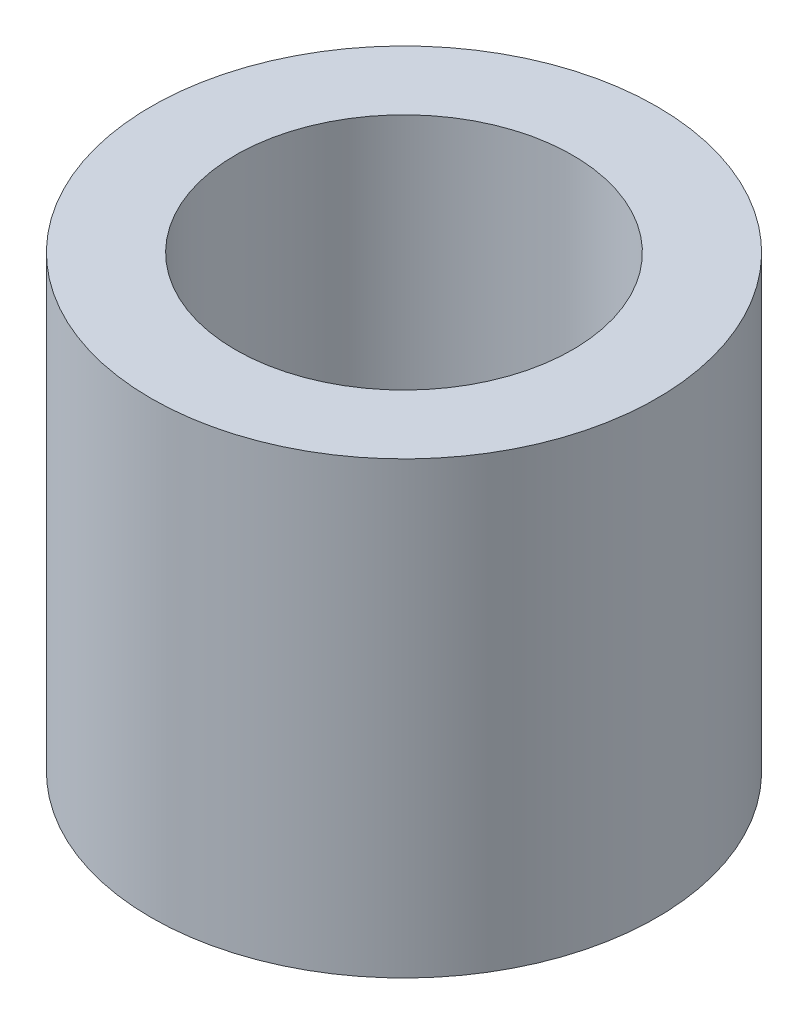
ISO-10303-21;
HEADER;
FILE_DESCRIPTION(('STEP AP214'),'2;1');
FILE_NAME('part.step','',(''),(''),'','','');
FILE_SCHEMA(('AUTOMOTIVE_DESIGN { 1 0 10303 214 1 1 1 1 }'));
ENDSEC;
DATA;
#1=APPLICATION_CONTEXT('core data for automotive mechanical design processes');
#2=APPLICATION_PROTOCOL_DEFINITION('international standard','automotive_design',2000,#1);
#3=PRODUCT_CONTEXT('',#1,'mechanical');
#4=PRODUCT('Part','Part','',(#3));
#5=PRODUCT_RELATED_PRODUCT_CATEGORY('part','',(#4));
#6=PRODUCT_DEFINITION_FORMATION('','',#4);
#7=PRODUCT_DEFINITION_CONTEXT('part definition',#1,'design');
#8=PRODUCT_DEFINITION('design','',#6,#7);
#9=PRODUCT_DEFINITION_SHAPE('','',#8);
#10=(LENGTH_UNIT() NAMED_UNIT(*) SI_UNIT(.MILLI.,.METRE.));
#11=(NAMED_UNIT(*) PLANE_ANGLE_UNIT() SI_UNIT($,.RADIAN.));
#12=(NAMED_UNIT(*) SI_UNIT($,.STERADIAN.) SOLID_ANGLE_UNIT());
#13=UNCERTAINTY_MEASURE_WITH_UNIT(LENGTH_MEASURE(1.E-05),#10,'distance_accuracy_value','');
#14=(GEOMETRIC_REPRESENTATION_CONTEXT(3) GLOBAL_UNCERTAINTY_ASSIGNED_CONTEXT((#13)) GLOBAL_UNIT_ASSIGNED_CONTEXT((#10,
#11,#12)) REPRESENTATION_CONTEXT('',''));
#15=CARTESIAN_POINT('',(0.,0.,0.));
#16=DIRECTION('',(0.,0.,1.));
#17=DIRECTION('',(1.,0.,0.));
#18=AXIS2_PLACEMENT_3D('',#15,#16,#17);
#19=CARTESIAN_POINT('',(0.,4.,0.));
#20=DIRECTION('',(0.,1.,0.));
#21=DIRECTION('',(0.,0.,1.));
#22=AXIS2_PLACEMENT_3D('',#19,#20,#21);
#23=PLANE('',#22);
#24=CARTESIAN_POINT('',(0.,4.,0.));
#25=DIRECTION('',(0.,1.,0.));
#26=DIRECTION('',(0.,0.,1.));
#27=AXIS2_PLACEMENT_3D('',#24,#25,#26);
#28=CIRCLE('',#27,2.25);
#29=CARTESIAN_POINT('',(0.,4.,2.25));
#30=VERTEX_POINT('',#29);
#31=EDGE_CURVE('E10',#30,#30,#28,.T.);
#32=ORIENTED_EDGE('',*,*,#31,.T.);
#33=EDGE_LOOP('',(#32));
#34=FACE_BOUND('',#33,.T.);
#35=CARTESIAN_POINT('',(0.,4.,0.));
#36=DIRECTION('',(0.,1.,0.));
#37=DIRECTION('',(0.,0.,1.));
#38=AXIS2_PLACEMENT_3D('',#35,#36,#37);
#39=CIRCLE('',#38,1.5);
#40=CARTESIAN_POINT('',(0.,4.,1.5));
#41=VERTEX_POINT('',#40);
#42=EDGE_CURVE('E50',#41,#41,#39,.T.);
#43=ORIENTED_EDGE('',*,*,#42,.F.);
#44=EDGE_LOOP('',(#43));
#45=FACE_BOUND('',#44,.T.);
#46=ADVANCED_FACE('F37',(#34,#45),#23,.T.);
#47=CARTESIAN_POINT('',(0.,0.,0.));
#48=DIRECTION('',(0.,1.,0.));
#49=DIRECTION('',(0.,0.,1.));
#50=AXIS2_PLACEMENT_3D('',#47,#48,#49);
#51=PLANE('',#50);
#52=CARTESIAN_POINT('',(0.,0.,0.));
#53=DIRECTION('',(0.,1.,0.));
#54=DIRECTION('',(0.,0.,1.));
#55=AXIS2_PLACEMENT_3D('',#52,#53,#54);
#56=CIRCLE('',#55,2.25);
#57=CARTESIAN_POINT('',(0.,0.,2.25));
#58=VERTEX_POINT('',#57);
#59=EDGE_CURVE('E41',#58,#58,#56,.T.);
#60=ORIENTED_EDGE('',*,*,#59,.F.);
#61=EDGE_LOOP('',(#60));
#62=FACE_BOUND('',#61,.T.);
#63=CARTESIAN_POINT('',(0.,0.,0.));
#64=DIRECTION('',(0.,1.,0.));
#65=DIRECTION('',(0.,0.,1.));
#66=AXIS2_PLACEMENT_3D('',#63,#64,#65);
#67=CIRCLE('',#66,1.5);
#68=CARTESIAN_POINT('',(0.,0.,1.5));
#69=VERTEX_POINT('',#68);
#70=EDGE_CURVE('E52',#69,#69,#67,.T.);
#71=ORIENTED_EDGE('',*,*,#70,.T.);
#72=EDGE_LOOP('',(#71));
#73=FACE_BOUND('',#72,.T.);
#74=ADVANCED_FACE('F64',(#62,#73),#51,.F.);
#75=CARTESIAN_POINT('',(0.,4.,0.));
#76=DIRECTION('',(0.,-1.,0.));
#77=DIRECTION('',(0.,0.,-1.));
#78=AXIS2_PLACEMENT_3D('',#75,#76,#77);
#79=CYLINDRICAL_SURFACE('',#78,2.25);
#80=ORIENTED_EDGE('',*,*,#31,.F.);
#81=EDGE_LOOP('',(#80));
#82=FACE_BOUND('',#81,.T.);
#83=ORIENTED_EDGE('',*,*,#59,.T.);
#84=EDGE_LOOP('',(#83));
#85=FACE_BOUND('',#84,.T.);
#86=ADVANCED_FACE('F39',(#82,#85),#79,.T.);
#87=CARTESIAN_POINT('',(0.,4.,0.));
#88=DIRECTION('',(0.,-1.,0.));
#89=DIRECTION('',(0.,0.,-1.));
#90=AXIS2_PLACEMENT_3D('',#87,#88,#89);
#91=CYLINDRICAL_SURFACE('',#90,1.5);
#92=ORIENTED_EDGE('',*,*,#42,.T.);
#93=EDGE_LOOP('',(#92));
#94=FACE_BOUND('',#93,.T.);
#95=ORIENTED_EDGE('',*,*,#70,.F.);
#96=EDGE_LOOP('',(#95));
#97=FACE_BOUND('',#96,.T.);
#98=ADVANCED_FACE('F60',(#94,#97),#91,.F.);
#99=CLOSED_SHELL('',(#46,#74,#86,#98));
#100=MANIFOLD_SOLID_BREP('B2',#99);
#101=ADVANCED_BREP_SHAPE_REPRESENTATION('',(#18,#100),#14);
#102=SHAPE_DEFINITION_REPRESENTATION(#9,#101);
ENDSEC;
END-ISO-10303-21;
